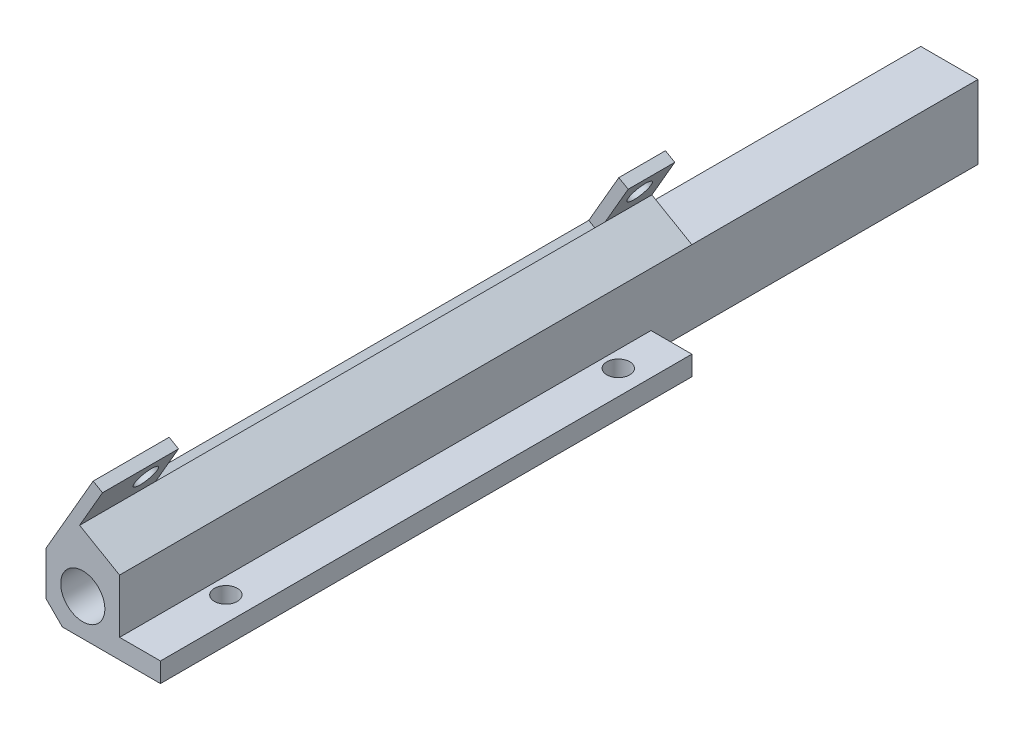
ISO-10303-21;
HEADER;
FILE_DESCRIPTION(('STEP AP214'),'2;1');
FILE_NAME('part.step','',(''),(''),'','','');
FILE_SCHEMA(('AUTOMOTIVE_DESIGN { 1 0 10303 214 1 1 1 1 }'));
ENDSEC;
DATA;
#1=APPLICATION_CONTEXT('core data for automotive mechanical design processes');
#2=APPLICATION_PROTOCOL_DEFINITION('international standard','automotive_design',2000,#1);
#3=PRODUCT_CONTEXT('',#1,'mechanical');
#4=PRODUCT('Part','Part','',(#3));
#5=PRODUCT_RELATED_PRODUCT_CATEGORY('part','',(#4));
#6=PRODUCT_DEFINITION_FORMATION('','',#4);
#7=PRODUCT_DEFINITION_CONTEXT('part definition',#1,'design');
#8=PRODUCT_DEFINITION('design','',#6,#7);
#9=PRODUCT_DEFINITION_SHAPE('','',#8);
#10=(LENGTH_UNIT() NAMED_UNIT(*) SI_UNIT(.MILLI.,.METRE.));
#11=(NAMED_UNIT(*) PLANE_ANGLE_UNIT() SI_UNIT($,.RADIAN.));
#12=(NAMED_UNIT(*) SI_UNIT($,.STERADIAN.) SOLID_ANGLE_UNIT());
#13=UNCERTAINTY_MEASURE_WITH_UNIT(LENGTH_MEASURE(1.E-05),#10,'distance_accuracy_value','');
#14=(GEOMETRIC_REPRESENTATION_CONTEXT(3) GLOBAL_UNCERTAINTY_ASSIGNED_CONTEXT((#13)) GLOBAL_UNIT_ASSIGNED_CONTEXT((#10,
#11,#12)) REPRESENTATION_CONTEXT('',''));
#15=CARTESIAN_POINT('',(0.,0.,0.));
#16=DIRECTION('',(0.,0.,1.));
#17=DIRECTION('',(1.,0.,0.));
#18=AXIS2_PLACEMENT_3D('',#15,#16,#17);
#19=CARTESIAN_POINT('',(8.14000854008915,20.0752380002227,-133.35));
#20=DIRECTION('',(-0.86602540378444,0.499999999999998,0.));
#21=DIRECTION('',(-0.499999999999998,-0.86602540378444,0.));
#22=AXIS2_PLACEMENT_3D('',#19,#20,#21);
#23=PLANE('',#22);
#24=CARTESIAN_POINT('',(7.12400854008916,18.3154743797327,-8.382));
#25=DIRECTION('',(-0.86602540378444,0.499999999999998,0.));
#26=DIRECTION('',(-0.499999999999998,-0.86602540378444,0.));
#27=AXIS2_PLACEMENT_3D('',#24,#25,#26);
#28=CIRCLE('',#27,1.778);
#29=CARTESIAN_POINT('',(6.23500854008916,16.775681211804,-8.382));
#30=VERTEX_POINT('',#29);
#31=EDGE_CURVE('E315',#30,#30,#28,.F.);
#32=ORIENTED_EDGE('',*,*,#31,.F.);
#33=EDGE_LOOP('',(#32));
#34=FACE_BOUND('',#33,.T.);
#35=DIRECTION('',(0.,0.,1.));
#36=VECTOR('',#35,1.);
#37=CARTESIAN_POINT('',(5.21900854008915,15.015917591314,-133.35));
#38=LINE('',#37,#36);
#39=CARTESIAN_POINT('',(5.21900854008915,15.015917591314,-11.811));
#40=VERTEX_POINT('',#39);
#41=CARTESIAN_POINT('',(5.21900854008915,15.015917591314,0.));
#42=VERTEX_POINT('',#41);
#43=EDGE_CURVE('E311',#40,#42,#38,.T.);
#44=ORIENTED_EDGE('',*,*,#43,.F.);
#45=DIRECTION('',(-0.499999999999998,-0.86602540378444,0.));
#46=VECTOR('',#45,1.);
#47=CARTESIAN_POINT('',(8.77500854008915,21.175090263029,-11.811));
#48=LINE('',#47,#46);
#49=CARTESIAN_POINT('',(8.77500854008915,21.175090263029,-11.811));
#50=VERTEX_POINT('',#49);
#51=EDGE_CURVE('E353',#50,#40,#48,.T.);
#52=ORIENTED_EDGE('',*,*,#51,.F.);
#53=DIRECTION('',(0.,0.,-1.));
#54=VECTOR('',#53,1.);
#55=CARTESIAN_POINT('',(8.7750085400892,21.1750902630289,-88.9));
#56=LINE('',#55,#54);
#57=CARTESIAN_POINT('',(8.77500854008921,21.1750902630289,0.));
#58=VERTEX_POINT('',#57);
#59=EDGE_CURVE('E376',#58,#50,#56,.T.);
#60=ORIENTED_EDGE('',*,*,#59,.F.);
#61=DIRECTION('',(-0.499999999999998,-0.86602540378444,0.));
#62=VECTOR('',#61,1.);
#63=CARTESIAN_POINT('',(8.14000854008915,20.0752380002227,0.));
#64=LINE('',#63,#62);
#65=EDGE_CURVE('E309',#58,#42,#64,.T.);
#66=ORIENTED_EDGE('',*,*,#65,.T.);
#67=EDGE_LOOP('',(#44,#52,#60,#66));
#68=FACE_BOUND('',#67,.T.);
#69=ADVANCED_FACE('F40',(#34,#68),#23,.F.);
#70=CARTESIAN_POINT('',(11.3628351826282,19.681007854343,0.));
#71=DIRECTION('',(0.500000000000004,0.866025403784437,0.));
#72=DIRECTION('',(-0.866025403784436,0.500000000000004,0.));
#73=AXIS2_PLACEMENT_3D('',#70,#71,#72);
#74=PLANE('',#73);
#75=DIRECTION('',(0.86602540378444,-0.499999999999998,0.));
#76=VECTOR('',#75,1.);
#77=CARTESIAN_POINT('',(1.82953005299964,25.1850641372008,-11.811));
#78=LINE('',#77,#76);
#79=CARTESIAN_POINT('',(7.3228522628063,22.0134930806236,-11.811));
#80=VERTEX_POINT('',#79);
#81=EDGE_CURVE('E367',#80,#50,#78,.T.);
#82=ORIENTED_EDGE('',*,*,#81,.F.);
#83=DIRECTION('',(0.,0.,1.));
#84=VECTOR('',#83,1.);
#85=CARTESIAN_POINT('',(7.32285226280629,22.0134930806237,-88.9));
#86=LINE('',#85,#84);
#87=CARTESIAN_POINT('',(7.3228522628063,22.0134930806236,0.));
#88=VERTEX_POINT('',#87);
#89=EDGE_CURVE('E361',#80,#88,#86,.T.);
#90=ORIENTED_EDGE('',*,*,#89,.T.);
#91=DIRECTION('',(0.866025403784436,-0.500000000000004,0.));
#92=VECTOR('',#91,1.);
#93=CARTESIAN_POINT('',(7.3228522628063,22.0134930806236,0.));
#94=LINE('',#93,#92);
#95=EDGE_CURVE('E372',#88,#58,#94,.T.);
#96=ORIENTED_EDGE('',*,*,#95,.T.);
#97=ORIENTED_EDGE('',*,*,#59,.T.);
#98=EDGE_LOOP('',(#82,#90,#96,#97));
#99=FACE_BOUND('',#98,.T.);
#100=ADVANCED_FACE('F338',(#99),#74,.T.);
#101=CARTESIAN_POINT('',(13.97,0.,-13.97));
#102=DIRECTION('',(0.,1.,0.));
#103=DIRECTION('',(0.,0.,1.));
#104=AXIS2_PLACEMENT_3D('',#101,#102,#103);
#105=CYLINDRICAL_SURFACE('',#104,1.778);
#106=CARTESIAN_POINT('',(13.97,0.,-13.97));
#107=DIRECTION('',(0.,1.,0.));
#108=DIRECTION('',(0.,0.,1.));
#109=AXIS2_PLACEMENT_3D('',#106,#107,#108);
#110=CIRCLE('',#109,1.778);
#111=CARTESIAN_POINT('',(13.97,0.,-12.192));
#112=VERTEX_POINT('',#111);
#113=EDGE_CURVE('E276',#112,#112,#110,.T.);
#114=ORIENTED_EDGE('',*,*,#113,.F.);
#115=EDGE_LOOP('',(#114));
#116=FACE_BOUND('',#115,.T.);
#117=CARTESIAN_POINT('',(13.97,3.048,-13.97));
#118=DIRECTION('',(0.,1.,0.));
#119=DIRECTION('',(0.,0.,1.));
#120=AXIS2_PLACEMENT_3D('',#117,#118,#119);
#121=CIRCLE('',#120,1.778);
#122=CARTESIAN_POINT('',(13.97,3.048,-12.192));
#123=VERTEX_POINT('',#122);
#124=EDGE_CURVE('E306',#123,#123,#121,.F.);
#125=ORIENTED_EDGE('',*,*,#124,.F.);
#126=EDGE_LOOP('',(#125));
#127=FACE_BOUND('',#126,.T.);
#128=ADVANCED_FACE('F343',(#116,#127),#105,.F.);
#129=CARTESIAN_POINT('',(13.97,0.,-74.93));
#130=DIRECTION('',(0.,1.,0.));
#131=DIRECTION('',(0.,0.,1.));
#132=AXIS2_PLACEMENT_3D('',#129,#130,#131);
#133=CYLINDRICAL_SURFACE('',#132,1.778);
#134=CARTESIAN_POINT('',(13.97,0.,-74.93));
#135=DIRECTION('',(0.,1.,0.));
#136=DIRECTION('',(0.,0.,1.));
#137=AXIS2_PLACEMENT_3D('',#134,#135,#136);
#138=CIRCLE('',#137,1.778);
#139=CARTESIAN_POINT('',(13.97,0.,-73.152));
#140=VERTEX_POINT('',#139);
#141=EDGE_CURVE('E277',#140,#140,#138,.T.);
#142=ORIENTED_EDGE('',*,*,#141,.F.);
#143=EDGE_LOOP('',(#142));
#144=FACE_BOUND('',#143,.T.);
#145=CARTESIAN_POINT('',(13.97,3.048,-74.93));
#146=DIRECTION('',(0.,1.,0.));
#147=DIRECTION('',(0.,0.,1.));
#148=AXIS2_PLACEMENT_3D('',#145,#146,#147);
#149=CIRCLE('',#148,1.778);
#150=CARTESIAN_POINT('',(13.97,3.048,-73.152));
#151=VERTEX_POINT('',#150);
#152=EDGE_CURVE('E298',#151,#151,#149,.F.);
#153=ORIENTED_EDGE('',*,*,#152,.F.);
#154=EDGE_LOOP('',(#153));
#155=FACE_BOUND('',#154,.T.);
#156=ADVANCED_FACE('F514',(#144,#155),#133,.F.);
#157=CARTESIAN_POINT('',(17.78,5.08,-76.2));
#158=DIRECTION('',(-1.,0.,0.));
#159=DIRECTION('',(0.,0.,1.));
#160=AXIS2_PLACEMENT_3D('',#157,#158,#159);
#161=PLANE('',#160);
#162=DIRECTION('',(0.,0.,-1.));
#163=VECTOR('',#162,1.);
#164=CARTESIAN_POINT('',(17.78,3.048,0.));
#165=LINE('',#164,#163);
#166=CARTESIAN_POINT('',(17.78,3.048,0.));
#167=VERTEX_POINT('',#166);
#168=CARTESIAN_POINT('',(17.78,3.048,-82.55));
#169=VERTEX_POINT('',#168);
#170=EDGE_CURVE('E300',#167,#169,#165,.T.);
#171=ORIENTED_EDGE('',*,*,#170,.F.);
#172=DIRECTION('',(0.,-1.,0.));
#173=VECTOR('',#172,1.);
#174=CARTESIAN_POINT('',(17.78,5.08,0.));
#175=LINE('',#174,#173);
#176=CARTESIAN_POINT('',(17.78,0.,0.));
#177=VERTEX_POINT('',#176);
#178=EDGE_CURVE('E179',#167,#177,#175,.T.);
#179=ORIENTED_EDGE('',*,*,#178,.T.);
#180=DIRECTION('',(0.,0.,1.));
#181=VECTOR('',#180,1.);
#182=CARTESIAN_POINT('',(17.78,0.,-76.2));
#183=LINE('',#182,#181);
#184=CARTESIAN_POINT('',(17.78,0.,-82.55));
#185=VERTEX_POINT('',#184);
#186=EDGE_CURVE('E172',#185,#177,#183,.T.);
#187=ORIENTED_EDGE('',*,*,#186,.F.);
#188=DIRECTION('',(0.,1.,0.));
#189=VECTOR('',#188,1.);
#190=CARTESIAN_POINT('',(17.78,-0.00100000000000013,-82.55));
#191=LINE('',#190,#189);
#192=EDGE_CURVE('E176',#185,#169,#191,.T.);
#193=ORIENTED_EDGE('',*,*,#192,.T.);
#194=EDGE_LOOP('',(#171,#179,#187,#193));
#195=FACE_BOUND('',#194,.T.);
#196=ADVANCED_FACE('F175',(#195),#161,.F.);
#197=CARTESIAN_POINT('',(0.379816987298136,22.2092351882031,-85.09));
#198=DIRECTION('',(0.866025403784436,-0.500000000000004,0.));
#199=DIRECTION('',(0.500000000000004,0.866025403784436,0.));
#200=AXIS2_PLACEMENT_3D('',#197,#198,#199);
#201=CYLINDRICAL_SURFACE('',#200,1.77800000000001);
#202=CARTESIAN_POINT('',(7.12400854008916,18.3154743797327,-85.09));
#203=DIRECTION('',(-0.86602540378444,0.499999999999998,0.));
#204=DIRECTION('',(-0.499999999999998,-0.86602540378444,0.));
#205=AXIS2_PLACEMENT_3D('',#202,#203,#204);
#206=CIRCLE('',#205,1.77800000000001);
#207=CARTESIAN_POINT('',(6.23500854008916,16.775681211804,-85.09));
#208=VERTEX_POINT('',#207);
#209=EDGE_CURVE('E256',#208,#208,#206,.F.);
#210=ORIENTED_EDGE('',*,*,#209,.T.);
#211=EDGE_LOOP('',(#210));
#212=FACE_BOUND('',#211,.T.);
#213=CARTESIAN_POINT('',(5.67185226280627,19.1538771973274,-85.09));
#214=DIRECTION('',(-0.866025403784436,0.500000000000004,0.));
#215=DIRECTION('',(-0.500000000000004,-0.866025403784436,0.));
#216=AXIS2_PLACEMENT_3D('',#213,#214,#215);
#217=CIRCLE('',#216,1.77800000000001);
#218=CARTESIAN_POINT('',(4.78285226280626,17.6140840293987,-85.09));
#219=VERTEX_POINT('',#218);
#220=EDGE_CURVE('E243',#219,#219,#217,.F.);
#221=ORIENTED_EDGE('',*,*,#220,.F.);
#222=EDGE_LOOP('',(#221));
#223=FACE_BOUND('',#222,.T.);
#224=ADVANCED_FACE('F320',(#212,#223),#201,.F.);
#225=CARTESIAN_POINT('',(0.379816987298136,22.2092351882031,-8.382));
#226=DIRECTION('',(0.866025403784436,-0.500000000000004,0.));
#227=DIRECTION('',(0.500000000000004,0.866025403784436,0.));
#228=AXIS2_PLACEMENT_3D('',#225,#226,#227);
#229=CYLINDRICAL_SURFACE('',#228,1.778);
#230=ORIENTED_EDGE('',*,*,#31,.T.);
#231=EDGE_LOOP('',(#230));
#232=FACE_BOUND('',#231,.T.);
#233=CARTESIAN_POINT('',(5.67185226280627,19.1538771973274,-8.382));
#234=DIRECTION('',(-0.866025403784436,0.500000000000004,0.));
#235=DIRECTION('',(-0.500000000000004,-0.866025403784436,0.));
#236=AXIS2_PLACEMENT_3D('',#233,#234,#235);
#237=CIRCLE('',#236,1.778);
#238=CARTESIAN_POINT('',(4.78285226280626,17.6140840293987,-8.382));
#239=VERTEX_POINT('',#238);
#240=EDGE_CURVE('E241',#239,#239,#237,.F.);
#241=ORIENTED_EDGE('',*,*,#240,.F.);
#242=EDGE_LOOP('',(#241));
#243=FACE_BOUND('',#242,.T.);
#244=ADVANCED_FACE('F533',(#232,#243),#229,.F.);
#245=CARTESIAN_POINT('',(0.,11.43,0.));
#246=DIRECTION('',(0.,-1.,0.));
#247=DIRECTION('',(0.,0.,-1.));
#248=AXIS2_PLACEMENT_3D('',#245,#246,#247);
#249=PLANE('',#248);
#250=DIRECTION('',(1.,0.,0.));
#251=VECTOR('',#250,1.);
#252=CARTESIAN_POINT('',(11.43,11.43,-88.9));
#253=LINE('',#252,#251);
#254=CARTESIAN_POINT('',(2.54000000000003,11.43,-88.9));
#255=VERTEX_POINT('',#254);
#256=CARTESIAN_POINT('',(11.43,11.43,-88.9));
#257=VERTEX_POINT('',#256);
#258=EDGE_CURVE('E264',#255,#257,#253,.T.);
#259=ORIENTED_EDGE('',*,*,#258,.T.);
#260=DIRECTION('',(0.,0.,1.));
#261=VECTOR('',#260,1.);
#262=CARTESIAN_POINT('',(11.43,11.43,-133.35));
#263=LINE('',#262,#261);
#264=CARTESIAN_POINT('',(11.43,11.43,-133.35));
#265=VERTEX_POINT('',#264);
#266=EDGE_CURVE('E204',#265,#257,#263,.T.);
#267=ORIENTED_EDGE('',*,*,#266,.F.);
#268=DIRECTION('',(-1.,0.,0.));
#269=VECTOR('',#268,1.);
#270=CARTESIAN_POINT('',(0.,11.43,-133.35));
#271=LINE('',#270,#269);
#272=CARTESIAN_POINT('',(2.54,11.43,-133.35));
#273=VERTEX_POINT('',#272);
#274=EDGE_CURVE('E217',#265,#273,#271,.T.);
#275=ORIENTED_EDGE('',*,*,#274,.T.);
#276=DIRECTION('',(0.,0.,1.));
#277=VECTOR('',#276,1.);
#278=CARTESIAN_POINT('',(2.54,11.43,0.));
#279=LINE('',#278,#277);
#280=EDGE_CURVE('E49',#273,#255,#279,.T.);
#281=ORIENTED_EDGE('',*,*,#280,.T.);
#282=EDGE_LOOP('',(#259,#267,#275,#281));
#283=FACE_BOUND('',#282,.T.);
#284=ADVANCED_FACE('F398',(#283),#249,.F.);
#285=CARTESIAN_POINT('',(2.54,11.43,0.));
#286=DIRECTION('',(0.707106781186548,-0.707106781186548,0.));
#287=DIRECTION('',(0.,0.,1.));
#288=AXIS2_PLACEMENT_3D('',#285,#286,#287);
#289=PLANE('',#288);
#290=DIRECTION('',(0.,0.,-1.));
#291=VECTOR('',#290,1.);
#292=CARTESIAN_POINT('',(0.,8.89,0.));
#293=LINE('',#292,#291);
#294=CARTESIAN_POINT('',(0.,8.88999999999997,-88.9));
#295=VERTEX_POINT('',#294);
#296=CARTESIAN_POINT('',(0.,8.89,-133.35));
#297=VERTEX_POINT('',#296);
#298=EDGE_CURVE('E228',#295,#297,#293,.T.);
#299=ORIENTED_EDGE('',*,*,#298,.F.);
#300=DIRECTION('',(0.707106781186547,0.707106781186547,0.));
#301=VECTOR('',#300,1.);
#302=CARTESIAN_POINT('',(2.54000000000003,11.43,-88.9));
#303=LINE('',#302,#301);
#304=EDGE_CURVE('E261',#295,#255,#303,.T.);
#305=ORIENTED_EDGE('',*,*,#304,.T.);
#306=ORIENTED_EDGE('',*,*,#280,.F.);
#307=DIRECTION('',(-0.707106781186548,-0.707106781186548,0.));
#308=VECTOR('',#307,1.);
#309=CARTESIAN_POINT('',(2.54,11.43,-133.35));
#310=LINE('',#309,#308);
#311=EDGE_CURVE('E64',#297,#273,#310,.F.);
#312=ORIENTED_EDGE('',*,*,#311,.F.);
#313=EDGE_LOOP('',(#299,#305,#306,#312));
#314=FACE_BOUND('',#313,.T.);
#315=ADVANCED_FACE('F43',(#314),#289,.F.);
#316=CARTESIAN_POINT('',(0.,11.43,0.));
#317=DIRECTION('',(1.,0.,0.));
#318=DIRECTION('',(0.,0.,-1.));
#319=AXIS2_PLACEMENT_3D('',#316,#317,#318);
#320=PLANE('',#319);
#321=DIRECTION('',(0.,-1.,0.));
#322=VECTOR('',#321,1.);
#323=CARTESIAN_POINT('',(0.,11.43,0.));
#324=LINE('',#323,#322);
#325=CARTESIAN_POINT('',(0.,9.32994090512259,0.));
#326=VERTEX_POINT('',#325);
#327=CARTESIAN_POINT('',(0.,2.54,0.));
#328=VERTEX_POINT('',#327);
#329=EDGE_CURVE('E226',#326,#328,#324,.T.);
#330=ORIENTED_EDGE('',*,*,#329,.F.);
#331=DIRECTION('',(0.,0.,1.));
#332=VECTOR('',#331,1.);
#333=CARTESIAN_POINT('',(0.,9.32994090512259,-88.9));
#334=LINE('',#333,#332);
#335=CARTESIAN_POINT('',(0.,9.32994090512259,-88.9));
#336=VERTEX_POINT('',#335);
#337=EDGE_CURVE('E193',#336,#326,#334,.T.);
#338=ORIENTED_EDGE('',*,*,#337,.F.);
#339=DIRECTION('',(0.,-1.,0.));
#340=VECTOR('',#339,1.);
#341=CARTESIAN_POINT('',(0.,8.88999999999997,-88.9));
#342=LINE('',#341,#340);
#343=EDGE_CURVE('E269',#336,#295,#342,.T.);
#344=ORIENTED_EDGE('',*,*,#343,.T.);
#345=ORIENTED_EDGE('',*,*,#298,.T.);
#346=DIRECTION('',(0.,-1.,0.));
#347=VECTOR('',#346,1.);
#348=CARTESIAN_POINT('',(0.,11.43,-133.35));
#349=LINE('',#348,#347);
#350=CARTESIAN_POINT('',(0.,2.54,-133.35));
#351=VERTEX_POINT('',#350);
#352=EDGE_CURVE('E219',#297,#351,#349,.T.);
#353=ORIENTED_EDGE('',*,*,#352,.T.);
#354=DIRECTION('',(0.,0.,1.));
#355=VECTOR('',#354,1.);
#356=CARTESIAN_POINT('',(0.,2.54,0.));
#357=LINE('',#356,#355);
#358=EDGE_CURVE('E230',#351,#328,#357,.T.);
#359=ORIENTED_EDGE('',*,*,#358,.T.);
#360=EDGE_LOOP('',(#330,#338,#344,#345,#353,#359));
#361=FACE_BOUND('',#360,.T.);
#362=ADVANCED_FACE('F390',(#361),#320,.F.);
#363=CARTESIAN_POINT('',(0.,11.43,0.));
#364=DIRECTION('',(0.,0.,-1.));
#365=DIRECTION('',(-1.,0.,0.));
#366=AXIS2_PLACEMENT_3D('',#363,#364,#365);
#367=PLANE('',#366);
#368=DIRECTION('',(0.500000000000004,0.866025403784436,0.));
#369=VECTOR('',#368,1.);
#370=CARTESIAN_POINT('',(6.68785226280628,20.9136408178174,0.));
#371=LINE('',#370,#369);
#372=EDGE_CURVE('E244',#326,#88,#371,.T.);
#373=ORIENTED_EDGE('',*,*,#372,.F.);
#374=ORIENTED_EDGE('',*,*,#329,.T.);
#375=DIRECTION('',(0.707106781186548,-0.707106781186548,0.));
#376=VECTOR('',#375,1.);
#377=CARTESIAN_POINT('',(0.,2.54,0.));
#378=LINE('',#377,#376);
#379=CARTESIAN_POINT('',(2.54,0.,0.));
#380=VERTEX_POINT('',#379);
#381=EDGE_CURVE('E233',#328,#380,#378,.T.);
#382=ORIENTED_EDGE('',*,*,#381,.T.);
#383=DIRECTION('',(1.,0.,0.));
#384=VECTOR('',#383,1.);
#385=CARTESIAN_POINT('',(0.,0.,0.));
#386=LINE('',#385,#384);
#387=EDGE_CURVE('E214',#380,#177,#386,.T.);
#388=ORIENTED_EDGE('',*,*,#387,.T.);
#389=ORIENTED_EDGE('',*,*,#178,.F.);
#390=DIRECTION('',(1.,0.,0.));
#391=VECTOR('',#390,1.);
#392=CARTESIAN_POINT('',(17.78,3.048,0.));
#393=LINE('',#392,#391);
#394=CARTESIAN_POINT('',(11.43,3.048,0.));
#395=VERTEX_POINT('',#394);
#396=EDGE_CURVE('E289',#395,#167,#393,.T.);
#397=ORIENTED_EDGE('',*,*,#396,.F.);
#398=DIRECTION('',(0.,1.,0.));
#399=VECTOR('',#398,1.);
#400=CARTESIAN_POINT('',(11.43,11.43,0.));
#401=LINE('',#400,#399);
#402=CARTESIAN_POINT('',(11.43,11.43,0.));
#403=VERTEX_POINT('',#402);
#404=EDGE_CURVE('E209',#395,#403,#401,.T.);
#405=ORIENTED_EDGE('',*,*,#404,.T.);
#406=DIRECTION('',(-0.866025403784436,0.500000000000004,0.));
#407=VECTOR('',#406,1.);
#408=CARTESIAN_POINT('',(5.93073868596882,14.605,0.));
#409=LINE('',#408,#407);
#410=EDGE_CURVE('E184',#403,#42,#409,.T.);
#411=ORIENTED_EDGE('',*,*,#410,.T.);
#412=ORIENTED_EDGE('',*,*,#65,.F.);
#413=ORIENTED_EDGE('',*,*,#95,.F.);
#414=EDGE_LOOP('',(#373,#374,#382,#388,#389,#397,#405,#411,#412,#413));
#415=FACE_BOUND('',#414,.T.);
#416=CARTESIAN_POINT('',(5.715,5.715,0.));
#417=DIRECTION('',(0.,0.,1.));
#418=DIRECTION('',(1.,0.,0.));
#419=AXIS2_PLACEMENT_3D('',#416,#417,#418);
#420=CIRCLE('',#419,3.429);
#421=CARTESIAN_POINT('',(9.144,5.715,0.));
#422=VERTEX_POINT('',#421);
#423=EDGE_CURVE('E202',#422,#422,#420,.T.);
#424=ORIENTED_EDGE('',*,*,#423,.F.);
#425=EDGE_LOOP('',(#424));
#426=FACE_BOUND('',#425,.T.);
#427=ADVANCED_FACE('F286',(#415,#426),#367,.F.);
#428=CARTESIAN_POINT('',(0.,11.43,-133.35));
#429=DIRECTION('',(0.,0.,1.));
#430=DIRECTION('',(1.,0.,0.));
#431=AXIS2_PLACEMENT_3D('',#428,#429,#430);
#432=PLANE('',#431);
#433=CARTESIAN_POINT('',(5.715,5.715,-133.35));
#434=DIRECTION('',(0.,0.,1.));
#435=DIRECTION('',(1.,0.,0.));
#436=AXIS2_PLACEMENT_3D('',#433,#434,#435);
#437=CIRCLE('',#436,3.429);
#438=CARTESIAN_POINT('',(9.144,5.715,-133.35));
#439=VERTEX_POINT('',#438);
#440=EDGE_CURVE('E211',#439,#439,#437,.T.);
#441=ORIENTED_EDGE('',*,*,#440,.T.);
#442=EDGE_LOOP('',(#441));
#443=FACE_BOUND('',#442,.T.);
#444=DIRECTION('',(-1.,0.,0.));
#445=VECTOR('',#444,1.);
#446=CARTESIAN_POINT('',(0.,0.,-133.35));
#447=LINE('',#446,#445);
#448=CARTESIAN_POINT('',(11.43,0.,-133.35));
#449=VERTEX_POINT('',#448);
#450=CARTESIAN_POINT('',(2.54,0.,-133.35));
#451=VERTEX_POINT('',#450);
#452=EDGE_CURVE('E220',#449,#451,#447,.T.);
#453=ORIENTED_EDGE('',*,*,#452,.T.);
#454=DIRECTION('',(-0.707106781186548,0.707106781186548,0.));
#455=VECTOR('',#454,1.);
#456=CARTESIAN_POINT('',(0.,2.54,-133.35));
#457=LINE('',#456,#455);
#458=EDGE_CURVE('E238',#451,#351,#457,.T.);
#459=ORIENTED_EDGE('',*,*,#458,.T.);
#460=ORIENTED_EDGE('',*,*,#352,.F.);
#461=ORIENTED_EDGE('',*,*,#311,.T.);
#462=ORIENTED_EDGE('',*,*,#274,.F.);
#463=DIRECTION('',(0.,1.,0.));
#464=VECTOR('',#463,1.);
#465=CARTESIAN_POINT('',(11.43,0.,-133.35));
#466=LINE('',#465,#464);
#467=EDGE_CURVE('E200',#449,#265,#466,.T.);
#468=ORIENTED_EDGE('',*,*,#467,.F.);
#469=EDGE_LOOP('',(#453,#459,#460,#461,#462,#468));
#470=FACE_BOUND('',#469,.T.);
#471=ADVANCED_FACE('F386',(#443,#470),#432,.F.);
#472=CARTESIAN_POINT('',(0.,0.,0.));
#473=DIRECTION('',(0.,-1.,0.));
#474=DIRECTION('',(0.,0.,-1.));
#475=AXIS2_PLACEMENT_3D('',#472,#473,#474);
#476=PLANE('',#475);
#477=DIRECTION('',(1.,0.,0.));
#478=VECTOR('',#477,1.);
#479=CARTESIAN_POINT('',(53.34,0.,-82.55));
#480=LINE('',#479,#478);
#481=CARTESIAN_POINT('',(11.43,0.,-82.55));
#482=VERTEX_POINT('',#481);
#483=EDGE_CURVE('E189',#482,#185,#480,.T.);
#484=ORIENTED_EDGE('',*,*,#483,.T.);
#485=ORIENTED_EDGE('',*,*,#186,.T.);
#486=ORIENTED_EDGE('',*,*,#387,.F.);
#487=DIRECTION('',(0.,0.,-1.));
#488=VECTOR('',#487,1.);
#489=CARTESIAN_POINT('',(2.54,0.,-133.35));
#490=LINE('',#489,#488);
#491=EDGE_CURVE('E235',#380,#451,#490,.T.);
#492=ORIENTED_EDGE('',*,*,#491,.T.);
#493=ORIENTED_EDGE('',*,*,#452,.F.);
#494=DIRECTION('',(0.,0.,1.));
#495=VECTOR('',#494,1.);
#496=CARTESIAN_POINT('',(11.43,0.,-133.35));
#497=LINE('',#496,#495);
#498=EDGE_CURVE('E198',#449,#482,#497,.T.);
#499=ORIENTED_EDGE('',*,*,#498,.T.);
#500=EDGE_LOOP('',(#484,#485,#486,#492,#493,#499));
#501=FACE_BOUND('',#500,.T.);
#502=ORIENTED_EDGE('',*,*,#141,.T.);
#503=EDGE_LOOP('',(#502));
#504=FACE_BOUND('',#503,.T.);
#505=ORIENTED_EDGE('',*,*,#113,.T.);
#506=EDGE_LOOP('',(#505));
#507=FACE_BOUND('',#506,.T.);
#508=ADVANCED_FACE('F195',(#501,#504,#507),#476,.T.);
#509=CARTESIAN_POINT('',(5.715,5.715,-133.35));
#510=DIRECTION('',(0.,0.,1.));
#511=DIRECTION('',(1.,0.,0.));
#512=AXIS2_PLACEMENT_3D('',#509,#510,#511);
#513=CYLINDRICAL_SURFACE('',#512,3.429);
#514=ORIENTED_EDGE('',*,*,#440,.F.);
#515=EDGE_LOOP('',(#514));
#516=FACE_BOUND('',#515,.T.);
#517=ORIENTED_EDGE('',*,*,#423,.T.);
#518=EDGE_LOOP('',(#517));
#519=FACE_BOUND('',#518,.T.);
#520=ADVANCED_FACE('F590',(#516,#519),#513,.F.);
#521=CARTESIAN_POINT('',(53.34,0.,-82.55));
#522=DIRECTION('',(0.,0.,1.));
#523=DIRECTION('',(1.,0.,0.));
#524=AXIS2_PLACEMENT_3D('',#521,#522,#523);
#525=PLANE('',#524);
#526=DIRECTION('',(-1.,0.,0.));
#527=VECTOR('',#526,1.);
#528=CARTESIAN_POINT('',(17.78,3.048,-82.55));
#529=LINE('',#528,#527);
#530=CARTESIAN_POINT('',(11.43,3.048,-82.55));
#531=VERTEX_POINT('',#530);
#532=EDGE_CURVE('E192',#169,#531,#529,.T.);
#533=ORIENTED_EDGE('',*,*,#532,.F.);
#534=ORIENTED_EDGE('',*,*,#192,.F.);
#535=ORIENTED_EDGE('',*,*,#483,.F.);
#536=DIRECTION('',(0.,1.,0.));
#537=VECTOR('',#536,1.);
#538=CARTESIAN_POINT('',(11.43,0.,-82.55));
#539=LINE('',#538,#537);
#540=EDGE_CURVE('E280',#482,#531,#539,.T.);
#541=ORIENTED_EDGE('',*,*,#540,.T.);
#542=EDGE_LOOP('',(#533,#534,#535,#541));
#543=FACE_BOUND('',#542,.T.);
#544=ADVANCED_FACE('F187',(#543),#525,.F.);
#545=CARTESIAN_POINT('',(11.43,0.,-133.35));
#546=DIRECTION('',(-1.,0.,0.));
#547=DIRECTION('',(0.,0.,1.));
#548=AXIS2_PLACEMENT_3D('',#545,#546,#547);
#549=PLANE('',#548);
#550=ORIENTED_EDGE('',*,*,#404,.F.);
#551=DIRECTION('',(0.,0.,1.));
#552=VECTOR('',#551,1.);
#553=CARTESIAN_POINT('',(11.43,3.048,0.));
#554=LINE('',#553,#552);
#555=EDGE_CURVE('E293',#531,#395,#554,.T.);
#556=ORIENTED_EDGE('',*,*,#555,.F.);
#557=ORIENTED_EDGE('',*,*,#540,.F.);
#558=ORIENTED_EDGE('',*,*,#498,.F.);
#559=ORIENTED_EDGE('',*,*,#467,.T.);
#560=ORIENTED_EDGE('',*,*,#266,.T.);
#561=DIRECTION('',(0.,0.,1.));
#562=VECTOR('',#561,1.);
#563=CARTESIAN_POINT('',(11.43,11.43,-88.9));
#564=LINE('',#563,#562);
#565=EDGE_CURVE('E271',#257,#403,#564,.T.);
#566=ORIENTED_EDGE('',*,*,#565,.T.);
#567=EDGE_LOOP('',(#550,#556,#557,#558,#559,#560,#566));
#568=FACE_BOUND('',#567,.T.);
#569=ADVANCED_FACE('F292',(#568),#549,.F.);
#570=CARTESIAN_POINT('',(0.,2.54,0.));
#571=DIRECTION('',(-0.707106781186548,-0.707106781186548,0.));
#572=DIRECTION('',(0.,0.,-1.));
#573=AXIS2_PLACEMENT_3D('',#570,#571,#572);
#574=PLANE('',#573);
#575=ORIENTED_EDGE('',*,*,#458,.F.);
#576=ORIENTED_EDGE('',*,*,#491,.F.);
#577=ORIENTED_EDGE('',*,*,#381,.F.);
#578=ORIENTED_EDGE('',*,*,#358,.F.);
#579=EDGE_LOOP('',(#575,#576,#577,#578));
#580=FACE_BOUND('',#579,.T.);
#581=ADVANCED_FACE('F384',(#580),#574,.T.);
#582=CARTESIAN_POINT('',(5.93073868596882,14.605,-88.9));
#583=DIRECTION('',(0.500000000000004,0.866025403784436,0.));
#584=DIRECTION('',(-0.866025403784436,0.500000000000004,0.));
#585=AXIS2_PLACEMENT_3D('',#582,#583,#584);
#586=PLANE('',#585);
#587=DIRECTION('',(-0.866025403784436,0.500000000000004,0.));
#588=VECTOR('',#587,1.);
#589=CARTESIAN_POINT('',(5.93073868596882,14.605,-88.9));
#590=LINE('',#589,#588);
#591=CARTESIAN_POINT('',(5.21900854008915,15.015917591314,-88.9));
#592=VERTEX_POINT('',#591);
#593=EDGE_CURVE('E267',#257,#592,#590,.T.);
#594=ORIENTED_EDGE('',*,*,#593,.T.);
#595=CARTESIAN_POINT('',(5.21900854008915,15.015917591314,-81.661));
#596=VERTEX_POINT('',#595);
#597=EDGE_CURVE('E312',#592,#596,#38,.T.);
#598=ORIENTED_EDGE('',*,*,#597,.T.);
#599=DIRECTION('',(0.,0.,-1.));
#600=VECTOR('',#599,1.);
#601=CARTESIAN_POINT('',(5.21900854008917,15.015917591314,-88.9));
#602=LINE('',#601,#600);
#603=EDGE_CURVE('E356',#40,#596,#602,.T.);
#604=ORIENTED_EDGE('',*,*,#603,.F.);
#605=ORIENTED_EDGE('',*,*,#43,.T.);
#606=ORIENTED_EDGE('',*,*,#410,.F.);
#607=ORIENTED_EDGE('',*,*,#565,.F.);
#608=EDGE_LOOP('',(#594,#598,#604,#605,#606,#607));
#609=FACE_BOUND('',#608,.T.);
#610=ADVANCED_FACE('F357',(#609),#586,.T.);
#611=CARTESIAN_POINT('',(0.,0.,-88.9));
#612=DIRECTION('',(0.,0.,1.));
#613=DIRECTION('',(1.,0.,0.));
#614=AXIS2_PLACEMENT_3D('',#611,#612,#613);
#615=PLANE('',#614);
#616=ORIENTED_EDGE('',*,*,#343,.F.);
#617=DIRECTION('',(-0.500000000000004,-0.866025403784436,0.));
#618=VECTOR('',#617,1.);
#619=CARTESIAN_POINT('',(6.68785226280628,20.9136408178174,-88.9));
#620=LINE('',#619,#618);
#621=CARTESIAN_POINT('',(7.32285226280629,22.0134930806237,-88.9));
#622=VERTEX_POINT('',#621);
#623=EDGE_CURVE('E250',#622,#336,#620,.T.);
#624=ORIENTED_EDGE('',*,*,#623,.F.);
#625=DIRECTION('',(-0.866025403784437,0.500000000000003,0.));
#626=VECTOR('',#625,1.);
#627=CARTESIAN_POINT('',(7.32285226280629,22.0134930806237,-88.9));
#628=LINE('',#627,#626);
#629=CARTESIAN_POINT('',(8.7750085400892,21.1750902630289,-88.9));
#630=VERTEX_POINT('',#629);
#631=EDGE_CURVE('E378',#630,#622,#628,.T.);
#632=ORIENTED_EDGE('',*,*,#631,.F.);
#633=DIRECTION('',(-0.499999999999998,-0.86602540378444,0.));
#634=VECTOR('',#633,1.);
#635=CARTESIAN_POINT('',(-2.58782664253888,1.4940824086859,-88.9));
#636=LINE('',#635,#634);
#637=EDGE_CURVE('E11',#630,#592,#636,.T.);
#638=ORIENTED_EDGE('',*,*,#637,.T.);
#639=ORIENTED_EDGE('',*,*,#593,.F.);
#640=ORIENTED_EDGE('',*,*,#258,.F.);
#641=ORIENTED_EDGE('',*,*,#304,.F.);
#642=EDGE_LOOP('',(#616,#624,#632,#638,#639,#640,#641));
#643=FACE_BOUND('',#642,.T.);
#644=ADVANCED_FACE('F334',(#643),#615,.F.);
#645=CARTESIAN_POINT('',(-4.03998291982189,2.33248522628068,0.));
#646=DIRECTION('',(-0.866025403784436,0.500000000000004,0.));
#647=DIRECTION('',(-0.500000000000004,-0.866025403784436,0.));
#648=AXIS2_PLACEMENT_3D('',#645,#646,#647);
#649=PLANE('',#648);
#650=DIRECTION('',(-0.500000000000004,-0.866025403784436,0.));
#651=VECTOR('',#650,1.);
#652=CARTESIAN_POINT('',(7.32285226280625,22.0134930806236,-11.811));
#653=LINE('',#652,#651);
#654=CARTESIAN_POINT('',(2.65560226280624,13.9295789489978,-11.811));
#655=VERTEX_POINT('',#654);
#656=EDGE_CURVE('E430',#80,#655,#653,.T.);
#657=ORIENTED_EDGE('',*,*,#656,.T.);
#658=DIRECTION('',(0.,0.,-1.));
#659=VECTOR('',#658,1.);
#660=CARTESIAN_POINT('',(2.65560226280624,13.9295789489978,-11.811));
#661=LINE('',#660,#659);
#662=CARTESIAN_POINT('',(2.65560226280624,13.9295789489978,-81.661));
#663=VERTEX_POINT('',#662);
#664=EDGE_CURVE('E362',#655,#663,#661,.T.);
#665=ORIENTED_EDGE('',*,*,#664,.T.);
#666=DIRECTION('',(0.500000000000004,0.866025403784436,0.));
#667=VECTOR('',#666,1.);
#668=CARTESIAN_POINT('',(7.32285226280625,22.0134930806236,-81.661));
#669=LINE('',#668,#667);
#670=CARTESIAN_POINT('',(7.32285226280629,22.0134930806237,-81.661));
#671=VERTEX_POINT('',#670);
#672=EDGE_CURVE('E428',#663,#671,#669,.T.);
#673=ORIENTED_EDGE('',*,*,#672,.T.);
#674=EDGE_CURVE('E364',#622,#671,#86,.T.);
#675=ORIENTED_EDGE('',*,*,#674,.F.);
#676=ORIENTED_EDGE('',*,*,#623,.T.);
#677=ORIENTED_EDGE('',*,*,#337,.T.);
#678=ORIENTED_EDGE('',*,*,#372,.T.);
#679=ORIENTED_EDGE('',*,*,#89,.F.);
#680=EDGE_LOOP('',(#657,#665,#673,#675,#676,#677,#678,#679));
#681=FACE_BOUND('',#680,.T.);
#682=ORIENTED_EDGE('',*,*,#240,.T.);
#683=EDGE_LOOP('',(#682));
#684=FACE_BOUND('',#683,.T.);
#685=ORIENTED_EDGE('',*,*,#220,.T.);
#686=EDGE_LOOP('',(#685));
#687=FACE_BOUND('',#686,.T.);
#688=ADVANCED_FACE('F325',(#681,#684,#687),#649,.T.);
#689=CARTESIAN_POINT('',(8.7750085400892,21.1750902630289,-81.661));
#690=VERTEX_POINT('',#689);
#691=EDGE_CURVE('E375',#690,#630,#56,.T.);
#692=ORIENTED_EDGE('',*,*,#691,.F.);
#693=DIRECTION('',(0.499999999999998,0.86602540378444,0.));
#694=VECTOR('',#693,1.);
#695=CARTESIAN_POINT('',(8.77500854008915,21.175090263029,-81.661));
#696=LINE('',#695,#694);
#697=EDGE_CURVE('E56',#596,#690,#696,.T.);
#698=ORIENTED_EDGE('',*,*,#697,.F.);
#699=ORIENTED_EDGE('',*,*,#597,.F.);
#700=ORIENTED_EDGE('',*,*,#637,.F.);
#701=EDGE_LOOP('',(#692,#698,#699,#700));
#702=FACE_BOUND('',#701,.T.);
#703=ORIENTED_EDGE('',*,*,#209,.F.);
#704=EDGE_LOOP('',(#703));
#705=FACE_BOUND('',#704,.T.);
#706=ADVANCED_FACE('F323',(#702,#705),#23,.F.);
#707=CARTESIAN_POINT('',(0.,3.048,0.));
#708=DIRECTION('',(0.,1.,0.));
#709=DIRECTION('',(0.,0.,1.));
#710=AXIS2_PLACEMENT_3D('',#707,#708,#709);
#711=PLANE('',#710);
#712=ORIENTED_EDGE('',*,*,#170,.T.);
#713=ORIENTED_EDGE('',*,*,#532,.T.);
#714=ORIENTED_EDGE('',*,*,#555,.T.);
#715=ORIENTED_EDGE('',*,*,#396,.T.);
#716=EDGE_LOOP('',(#712,#713,#714,#715));
#717=FACE_BOUND('',#716,.T.);
#718=ORIENTED_EDGE('',*,*,#152,.T.);
#719=EDGE_LOOP('',(#718));
#720=FACE_BOUND('',#719,.T.);
#721=ORIENTED_EDGE('',*,*,#124,.T.);
#722=EDGE_LOOP('',(#721));
#723=FACE_BOUND('',#722,.T.);
#724=ADVANCED_FACE('F295',(#717,#720,#723),#711,.T.);
#725=DIRECTION('',(0.86602540378444,-0.499999999999998,0.));
#726=VECTOR('',#725,1.);
#727=CARTESIAN_POINT('',(1.82953005299964,25.1850641372008,-81.661));
#728=LINE('',#727,#726);
#729=EDGE_CURVE('E413',#671,#690,#728,.T.);
#730=ORIENTED_EDGE('',*,*,#729,.T.);
#731=ORIENTED_EDGE('',*,*,#691,.T.);
#732=ORIENTED_EDGE('',*,*,#631,.T.);
#733=ORIENTED_EDGE('',*,*,#674,.T.);
#734=EDGE_LOOP('',(#730,#731,#732,#733));
#735=FACE_BOUND('',#734,.T.);
#736=ADVANCED_FACE('F332',(#735),#74,.T.);
#737=CARTESIAN_POINT('',(1.82953005299964,25.1850641372008,-11.811));
#738=DIRECTION('',(0.,0.,1.));
#739=DIRECTION('',(0.,-1.,0.));
#740=AXIS2_PLACEMENT_3D('',#737,#738,#739);
#741=PLANE('',#740);
#742=ORIENTED_EDGE('',*,*,#81,.T.);
#743=ORIENTED_EDGE('',*,*,#51,.T.);
#744=CARTESIAN_POINT('',(4.10775854008917,13.0911761314031,-11.811));
#745=VERTEX_POINT('',#744);
#746=EDGE_CURVE('E425',#40,#745,#48,.T.);
#747=ORIENTED_EDGE('',*,*,#746,.T.);
#748=DIRECTION('',(0.86602540378444,-0.499999999999998,0.));
#749=VECTOR('',#748,1.);
#750=CARTESIAN_POINT('',(-2.83771994700033,17.101150005575,-11.811));
#751=LINE('',#750,#749);
#752=EDGE_CURVE('E407',#655,#745,#751,.T.);
#753=ORIENTED_EDGE('',*,*,#752,.F.);
#754=ORIENTED_EDGE('',*,*,#656,.F.);
#755=EDGE_LOOP('',(#742,#743,#747,#753,#754));
#756=FACE_BOUND('',#755,.T.);
#757=ADVANCED_FACE('F435',(#756),#741,.F.);
#758=CARTESIAN_POINT('',(1.82953005299964,25.1850641372008,-81.661));
#759=DIRECTION('',(0.,0.,-1.));
#760=DIRECTION('',(-1.,0.,0.));
#761=AXIS2_PLACEMENT_3D('',#758,#759,#760);
#762=PLANE('',#761);
#763=DIRECTION('',(0.86602540378444,-0.499999999999998,0.));
#764=VECTOR('',#763,1.);
#765=CARTESIAN_POINT('',(-2.83771994700033,17.101150005575,-81.661));
#766=LINE('',#765,#764);
#767=CARTESIAN_POINT('',(4.10775854008917,13.0911761314031,-81.661));
#768=VERTEX_POINT('',#767);
#769=EDGE_CURVE('E415',#663,#768,#766,.T.);
#770=ORIENTED_EDGE('',*,*,#769,.T.);
#771=EDGE_CURVE('E404',#768,#596,#696,.T.);
#772=ORIENTED_EDGE('',*,*,#771,.T.);
#773=ORIENTED_EDGE('',*,*,#697,.T.);
#774=ORIENTED_EDGE('',*,*,#729,.F.);
#775=ORIENTED_EDGE('',*,*,#672,.F.);
#776=EDGE_LOOP('',(#770,#772,#773,#774,#775));
#777=FACE_BOUND('',#776,.T.);
#778=ADVANCED_FACE('F426',(#777),#762,.F.);
#779=CARTESIAN_POINT('',(-2.83771994700033,17.101150005575,-11.811));
#780=DIRECTION('',(-0.499999999999998,-0.86602540378444,0.));
#781=DIRECTION('',(0.86602540378444,-0.499999999999998,0.));
#782=AXIS2_PLACEMENT_3D('',#779,#780,#781);
#783=PLANE('',#782);
#784=ORIENTED_EDGE('',*,*,#752,.T.);
#785=DIRECTION('',(0.,0.,-1.));
#786=VECTOR('',#785,1.);
#787=CARTESIAN_POINT('',(4.10775854008917,13.0911761314031,-11.811));
#788=LINE('',#787,#786);
#789=EDGE_CURVE('E405',#745,#768,#788,.T.);
#790=ORIENTED_EDGE('',*,*,#789,.T.);
#791=ORIENTED_EDGE('',*,*,#769,.F.);
#792=ORIENTED_EDGE('',*,*,#664,.F.);
#793=EDGE_LOOP('',(#784,#790,#791,#792));
#794=FACE_BOUND('',#793,.T.);
#795=ADVANCED_FACE('F420',(#794),#783,.F.);
#796=CARTESIAN_POINT('',(-2.58782664253888,1.4940824086859,0.));
#797=DIRECTION('',(0.86602540378444,-0.499999999999998,0.));
#798=DIRECTION('',(0.499999999999998,0.86602540378444,0.));
#799=AXIS2_PLACEMENT_3D('',#796,#797,#798);
#800=PLANE('',#799);
#801=ORIENTED_EDGE('',*,*,#603,.T.);
#802=ORIENTED_EDGE('',*,*,#771,.F.);
#803=ORIENTED_EDGE('',*,*,#789,.F.);
#804=ORIENTED_EDGE('',*,*,#746,.F.);
#805=EDGE_LOOP('',(#801,#802,#803,#804));
#806=FACE_BOUND('',#805,.T.);
#807=ADVANCED_FACE('F424',(#806),#800,.F.);
#808=CLOSED_SHELL('',(#69,#100,#128,#156,#196,#224,#244,#284,#315,#362,#427,#471,#508,#520,#544,
#569,#581,#610,#644,#688,#706,#724,#736,#757,#778,#795,#807));
#809=MANIFOLD_SOLID_BREP('B2',#808);
#810=ADVANCED_BREP_SHAPE_REPRESENTATION('',(#18,#809),#14);
#811=SHAPE_DEFINITION_REPRESENTATION(#9,#810);
ENDSEC;
END-ISO-10303-21;
